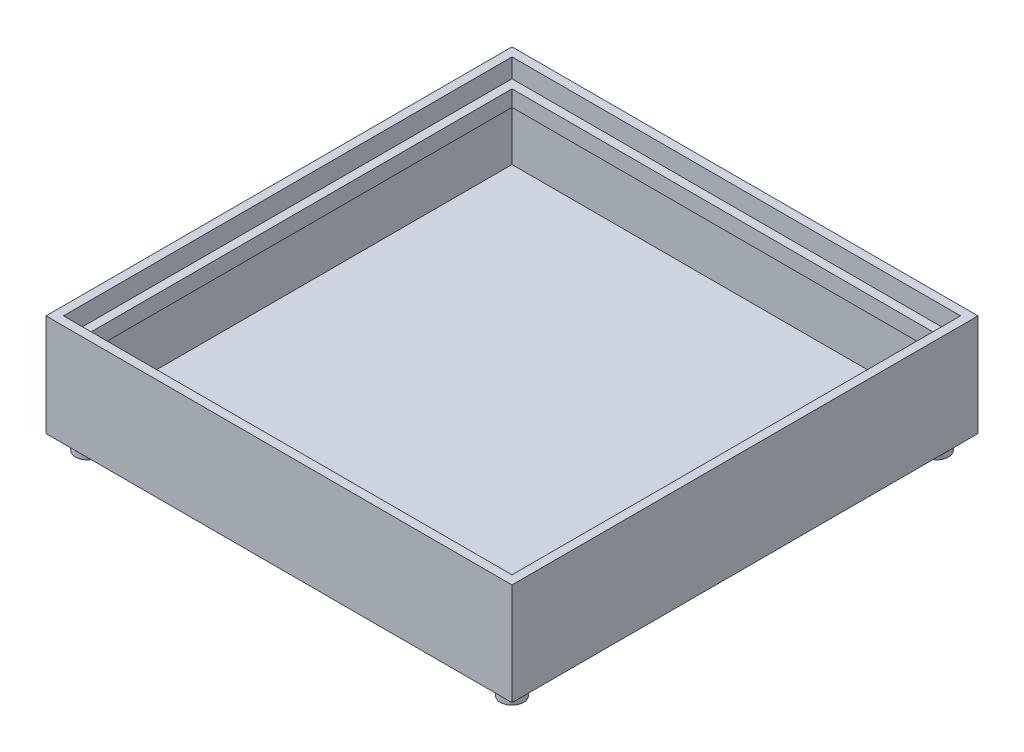
ISO-10303-21;
HEADER;
FILE_DESCRIPTION(('STEP AP214'),'2;1');
FILE_NAME('part.step','',(''),(''),'','','');
FILE_SCHEMA(('AUTOMOTIVE_DESIGN { 1 0 10303 214 1 1 1 1 }'));
ENDSEC;
DATA;
#1=APPLICATION_CONTEXT('core data for automotive mechanical design processes');
#2=APPLICATION_PROTOCOL_DEFINITION('international standard','automotive_design',2000,#1);
#3=PRODUCT_CONTEXT('',#1,'mechanical');
#4=PRODUCT('Part','Part','',(#3));
#5=PRODUCT_RELATED_PRODUCT_CATEGORY('part','',(#4));
#6=PRODUCT_DEFINITION_FORMATION('','',#4);
#7=PRODUCT_DEFINITION_CONTEXT('part definition',#1,'design');
#8=PRODUCT_DEFINITION('design','',#6,#7);
#9=PRODUCT_DEFINITION_SHAPE('','',#8);
#10=(LENGTH_UNIT() NAMED_UNIT(*) SI_UNIT(.MILLI.,.METRE.));
#11=(NAMED_UNIT(*) PLANE_ANGLE_UNIT() SI_UNIT($,.RADIAN.));
#12=(NAMED_UNIT(*) SI_UNIT($,.STERADIAN.) SOLID_ANGLE_UNIT());
#13=UNCERTAINTY_MEASURE_WITH_UNIT(LENGTH_MEASURE(1.E-05),#10,'distance_accuracy_value','');
#14=(GEOMETRIC_REPRESENTATION_CONTEXT(3) GLOBAL_UNCERTAINTY_ASSIGNED_CONTEXT((#13)) GLOBAL_UNIT_ASSIGNED_CONTEXT((#10,
#11,#12)) REPRESENTATION_CONTEXT('',''));
#15=CARTESIAN_POINT('',(0.,0.,0.));
#16=DIRECTION('',(0.,0.,1.));
#17=DIRECTION('',(1.,0.,0.));
#18=AXIS2_PLACEMENT_3D('',#15,#16,#17);
#19=CARTESIAN_POINT('',(-77.,23.,77.));
#20=DIRECTION('',(-1.,0.,0.));
#21=DIRECTION('',(0.,0.,1.));
#22=AXIS2_PLACEMENT_3D('',#19,#20,#21);
#23=PLANE('',#22);
#24=DIRECTION('',(0.,0.,-1.));
#25=VECTOR('',#24,1.);
#26=CARTESIAN_POINT('',(-77.,3.,77.));
#27=LINE('',#26,#25);
#28=CARTESIAN_POINT('',(-77.,3.,77.));
#29=VERTEX_POINT('',#28);
#30=CARTESIAN_POINT('',(-77.,3.,-77.));
#31=VERTEX_POINT('',#30);
#32=EDGE_CURVE('E186',#29,#31,#27,.T.);
#33=ORIENTED_EDGE('',*,*,#32,.T.);
#34=DIRECTION('',(0.,-1.,0.));
#35=VECTOR('',#34,1.);
#36=CARTESIAN_POINT('',(-77.,23.,-77.));
#37=LINE('',#36,#35);
#38=CARTESIAN_POINT('',(-77.,23.,-77.));
#39=VERTEX_POINT('',#38);
#40=EDGE_CURVE('E203',#39,#31,#37,.T.);
#41=ORIENTED_EDGE('',*,*,#40,.F.);
#42=DIRECTION('',(0.,0.,-1.));
#43=VECTOR('',#42,1.);
#44=CARTESIAN_POINT('',(-77.,23.,77.));
#45=LINE('',#44,#43);
#46=CARTESIAN_POINT('',(-77.,23.,77.));
#47=VERTEX_POINT('',#46);
#48=EDGE_CURVE('E190',#47,#39,#45,.T.);
#49=ORIENTED_EDGE('',*,*,#48,.F.);
#50=DIRECTION('',(0.,-1.,0.));
#51=VECTOR('',#50,1.);
#52=CARTESIAN_POINT('',(-77.,23.,77.));
#53=LINE('',#52,#51);
#54=EDGE_CURVE('E214',#47,#29,#53,.T.);
#55=ORIENTED_EDGE('',*,*,#54,.T.);
#56=EDGE_LOOP('',(#33,#41,#49,#55));
#57=FACE_BOUND('',#56,.T.);
#58=ADVANCED_FACE('F45',(#57),#23,.F.);
#59=CARTESIAN_POINT('',(77.,23.,77.));
#60=DIRECTION('',(0.,0.,1.));
#61=DIRECTION('',(1.,0.,0.));
#62=AXIS2_PLACEMENT_3D('',#59,#60,#61);
#63=PLANE('',#62);
#64=DIRECTION('',(-1.,0.,0.));
#65=VECTOR('',#64,1.);
#66=CARTESIAN_POINT('',(77.,3.,77.));
#67=LINE('',#66,#65);
#68=CARTESIAN_POINT('',(77.,3.,77.));
#69=VERTEX_POINT('',#68);
#70=EDGE_CURVE('E194',#69,#29,#67,.T.);
#71=ORIENTED_EDGE('',*,*,#70,.T.);
#72=ORIENTED_EDGE('',*,*,#54,.F.);
#73=DIRECTION('',(-1.,0.,0.));
#74=VECTOR('',#73,1.);
#75=CARTESIAN_POINT('',(77.,23.,77.));
#76=LINE('',#75,#74);
#77=CARTESIAN_POINT('',(77.,23.,77.));
#78=VERTEX_POINT('',#77);
#79=EDGE_CURVE('E200',#78,#47,#76,.T.);
#80=ORIENTED_EDGE('',*,*,#79,.F.);
#81=DIRECTION('',(0.,-1.,0.));
#82=VECTOR('',#81,1.);
#83=CARTESIAN_POINT('',(77.,23.,77.));
#84=LINE('',#83,#82);
#85=EDGE_CURVE('E217',#78,#69,#84,.T.);
#86=ORIENTED_EDGE('',*,*,#85,.T.);
#87=EDGE_LOOP('',(#71,#72,#80,#86));
#88=FACE_BOUND('',#87,.T.);
#89=ADVANCED_FACE('F336',(#88),#63,.F.);
#90=CARTESIAN_POINT('',(77.,23.,77.));
#91=DIRECTION('',(1.,0.,0.));
#92=DIRECTION('',(0.,0.,-1.));
#93=AXIS2_PLACEMENT_3D('',#90,#91,#92);
#94=PLANE('',#93);
#95=DIRECTION('',(0.,0.,1.));
#96=VECTOR('',#95,1.);
#97=CARTESIAN_POINT('',(77.,3.,77.));
#98=LINE('',#97,#96);
#99=CARTESIAN_POINT('',(77.,3.,-77.));
#100=VERTEX_POINT('',#99);
#101=EDGE_CURVE('E209',#100,#69,#98,.T.);
#102=ORIENTED_EDGE('',*,*,#101,.T.);
#103=ORIENTED_EDGE('',*,*,#85,.F.);
#104=DIRECTION('',(0.,0.,1.));
#105=VECTOR('',#104,1.);
#106=CARTESIAN_POINT('',(77.,23.,77.));
#107=LINE('',#106,#105);
#108=CARTESIAN_POINT('',(77.,23.,-77.));
#109=VERTEX_POINT('',#108);
#110=EDGE_CURVE('E197',#109,#78,#107,.T.);
#111=ORIENTED_EDGE('',*,*,#110,.F.);
#112=DIRECTION('',(0.,-1.,0.));
#113=VECTOR('',#112,1.);
#114=CARTESIAN_POINT('',(77.,23.,-77.));
#115=LINE('',#114,#113);
#116=EDGE_CURVE('E219',#109,#100,#115,.T.);
#117=ORIENTED_EDGE('',*,*,#116,.T.);
#118=EDGE_LOOP('',(#102,#103,#111,#117));
#119=FACE_BOUND('',#118,.T.);
#120=ADVANCED_FACE('F343',(#119),#94,.F.);
#121=CARTESIAN_POINT('',(77.,23.,-77.));
#122=DIRECTION('',(0.,0.,-1.));
#123=DIRECTION('',(-1.,0.,0.));
#124=AXIS2_PLACEMENT_3D('',#121,#122,#123);
#125=PLANE('',#124);
#126=DIRECTION('',(1.,0.,0.));
#127=VECTOR('',#126,1.);
#128=CARTESIAN_POINT('',(77.,3.,-77.));
#129=LINE('',#128,#127);
#130=EDGE_CURVE('E206',#31,#100,#129,.T.);
#131=ORIENTED_EDGE('',*,*,#130,.T.);
#132=ORIENTED_EDGE('',*,*,#116,.F.);
#133=DIRECTION('',(1.,0.,0.));
#134=VECTOR('',#133,1.);
#135=CARTESIAN_POINT('',(77.,23.,-77.));
#136=LINE('',#135,#134);
#137=EDGE_CURVE('E193',#39,#109,#136,.T.);
#138=ORIENTED_EDGE('',*,*,#137,.F.);
#139=ORIENTED_EDGE('',*,*,#40,.T.);
#140=EDGE_LOOP('',(#131,#132,#138,#139));
#141=FACE_BOUND('',#140,.T.);
#142=ADVANCED_FACE('F348',(#141),#125,.F.);
#143=CARTESIAN_POINT('',(0.,23.,0.));
#144=DIRECTION('',(0.,1.,0.));
#145=DIRECTION('',(0.,0.,1.));
#146=AXIS2_PLACEMENT_3D('',#143,#144,#145);
#147=PLANE('',#146);
#148=DIRECTION('',(1.,0.,0.));
#149=VECTOR('',#148,1.);
#150=CARTESIAN_POINT('',(0.,23.,74.));
#151=LINE('',#150,#149);
#152=CARTESIAN_POINT('',(-74.,23.,74.));
#153=VERTEX_POINT('',#152);
#154=CARTESIAN_POINT('',(74.,23.,74.));
#155=VERTEX_POINT('',#154);
#156=EDGE_CURVE('E287',#153,#155,#151,.T.);
#157=ORIENTED_EDGE('',*,*,#156,.T.);
#158=DIRECTION('',(0.,0.,-1.));
#159=VECTOR('',#158,1.);
#160=CARTESIAN_POINT('',(74.,23.,0.));
#161=LINE('',#160,#159);
#162=CARTESIAN_POINT('',(74.,23.,-74.));
#163=VERTEX_POINT('',#162);
#164=EDGE_CURVE('E290',#155,#163,#161,.T.);
#165=ORIENTED_EDGE('',*,*,#164,.T.);
#166=DIRECTION('',(-1.,0.,0.));
#167=VECTOR('',#166,1.);
#168=CARTESIAN_POINT('',(0.,23.,-74.));
#169=LINE('',#168,#167);
#170=CARTESIAN_POINT('',(-74.,23.,-74.));
#171=VERTEX_POINT('',#170);
#172=EDGE_CURVE('E163',#163,#171,#169,.T.);
#173=ORIENTED_EDGE('',*,*,#172,.T.);
#174=DIRECTION('',(0.,0.,1.));
#175=VECTOR('',#174,1.);
#176=CARTESIAN_POINT('',(-74.,23.,0.));
#177=LINE('',#176,#175);
#178=EDGE_CURVE('E284',#171,#153,#177,.T.);
#179=ORIENTED_EDGE('',*,*,#178,.T.);
#180=EDGE_LOOP('',(#157,#165,#173,#179));
#181=FACE_BOUND('',#180,.T.);
#182=ORIENTED_EDGE('',*,*,#48,.T.);
#183=ORIENTED_EDGE('',*,*,#137,.T.);
#184=ORIENTED_EDGE('',*,*,#110,.T.);
#185=ORIENTED_EDGE('',*,*,#79,.T.);
#186=EDGE_LOOP('',(#182,#183,#184,#185));
#187=FACE_BOUND('',#186,.T.);
#188=ADVANCED_FACE('F425',(#181,#187),#147,.F.);
#189=CARTESIAN_POINT('',(0.,3.,0.));
#190=DIRECTION('',(0.,1.,0.));
#191=DIRECTION('',(0.,0.,1.));
#192=AXIS2_PLACEMENT_3D('',#189,#190,#191);
#193=PLANE('',#192);
#194=ORIENTED_EDGE('',*,*,#32,.F.);
#195=ORIENTED_EDGE('',*,*,#70,.F.);
#196=ORIENTED_EDGE('',*,*,#101,.F.);
#197=ORIENTED_EDGE('',*,*,#130,.F.);
#198=EDGE_LOOP('',(#194,#195,#196,#197));
#199=FACE_BOUND('',#198,.T.);
#200=ADVANCED_FACE('F435',(#199),#193,.T.);
#201=CARTESIAN_POINT('',(74.,21.,74.));
#202=DIRECTION('',(1.,0.,0.));
#203=DIRECTION('',(0.,0.,-1.));
#204=AXIS2_PLACEMENT_3D('',#201,#202,#203);
#205=PLANE('',#204);
#206=DIRECTION('',(0.,1.,0.));
#207=VECTOR('',#206,1.);
#208=CARTESIAN_POINT('',(74.,21.,74.));
#209=LINE('',#208,#207);
#210=CARTESIAN_POINT('',(74.,28.5,74.));
#211=VERTEX_POINT('',#210);
#212=EDGE_CURVE('E172',#155,#211,#209,.T.);
#213=ORIENTED_EDGE('',*,*,#212,.T.);
#214=DIRECTION('',(0.,0.,-1.));
#215=VECTOR('',#214,1.);
#216=CARTESIAN_POINT('',(74.,28.5,74.));
#217=LINE('',#216,#215);
#218=CARTESIAN_POINT('',(74.,28.5,-74.));
#219=VERTEX_POINT('',#218);
#220=EDGE_CURVE('E169',#211,#219,#217,.T.);
#221=ORIENTED_EDGE('',*,*,#220,.T.);
#222=DIRECTION('',(0.,1.,0.));
#223=VECTOR('',#222,1.);
#224=CARTESIAN_POINT('',(74.,21.,-74.));
#225=LINE('',#224,#223);
#226=EDGE_CURVE('E157',#163,#219,#225,.T.);
#227=ORIENTED_EDGE('',*,*,#226,.F.);
#228=ORIENTED_EDGE('',*,*,#164,.F.);
#229=EDGE_LOOP('',(#213,#221,#227,#228));
#230=FACE_BOUND('',#229,.T.);
#231=ADVANCED_FACE('F170',(#230),#205,.F.);
#232=CARTESIAN_POINT('',(-74.,21.,74.));
#233=DIRECTION('',(0.,0.,1.));
#234=DIRECTION('',(1.,0.,0.));
#235=AXIS2_PLACEMENT_3D('',#232,#233,#234);
#236=PLANE('',#235);
#237=DIRECTION('',(0.,1.,0.));
#238=VECTOR('',#237,1.);
#239=CARTESIAN_POINT('',(-74.,21.,74.));
#240=LINE('',#239,#238);
#241=CARTESIAN_POINT('',(-74.,28.5,74.));
#242=VERTEX_POINT('',#241);
#243=EDGE_CURVE('E187',#153,#242,#240,.T.);
#244=ORIENTED_EDGE('',*,*,#243,.T.);
#245=DIRECTION('',(1.,0.,0.));
#246=VECTOR('',#245,1.);
#247=CARTESIAN_POINT('',(-74.,28.5,74.));
#248=LINE('',#247,#246);
#249=EDGE_CURVE('E166',#242,#211,#248,.T.);
#250=ORIENTED_EDGE('',*,*,#249,.T.);
#251=ORIENTED_EDGE('',*,*,#212,.F.);
#252=ORIENTED_EDGE('',*,*,#156,.F.);
#253=EDGE_LOOP('',(#244,#250,#251,#252));
#254=FACE_BOUND('',#253,.T.);
#255=ADVANCED_FACE('F453',(#254),#236,.F.);
#256=CARTESIAN_POINT('',(-74.,21.,74.));
#257=DIRECTION('',(-1.,0.,0.));
#258=DIRECTION('',(0.,0.,1.));
#259=AXIS2_PLACEMENT_3D('',#256,#257,#258);
#260=PLANE('',#259);
#261=DIRECTION('',(0.,1.,0.));
#262=VECTOR('',#261,1.);
#263=CARTESIAN_POINT('',(-74.,21.,-74.));
#264=LINE('',#263,#262);
#265=CARTESIAN_POINT('',(-74.,28.5,-74.));
#266=VERTEX_POINT('',#265);
#267=EDGE_CURVE('E67',#171,#266,#264,.T.);
#268=ORIENTED_EDGE('',*,*,#267,.T.);
#269=DIRECTION('',(0.,0.,1.));
#270=VECTOR('',#269,1.);
#271=CARTESIAN_POINT('',(-74.,28.5,74.));
#272=LINE('',#271,#270);
#273=EDGE_CURVE('E60',#266,#242,#272,.T.);
#274=ORIENTED_EDGE('',*,*,#273,.T.);
#275=ORIENTED_EDGE('',*,*,#243,.F.);
#276=ORIENTED_EDGE('',*,*,#178,.F.);
#277=EDGE_LOOP('',(#268,#274,#275,#276));
#278=FACE_BOUND('',#277,.T.);
#279=ADVANCED_FACE('F462',(#278),#260,.F.);
#280=CARTESIAN_POINT('',(-74.,21.,-74.));
#281=DIRECTION('',(0.,0.,-1.));
#282=DIRECTION('',(-1.,0.,0.));
#283=AXIS2_PLACEMENT_3D('',#280,#281,#282);
#284=PLANE('',#283);
#285=ORIENTED_EDGE('',*,*,#226,.T.);
#286=DIRECTION('',(-1.,0.,0.));
#287=VECTOR('',#286,1.);
#288=CARTESIAN_POINT('',(-74.,28.5,-74.));
#289=LINE('',#288,#287);
#290=EDGE_CURVE('E161',#219,#266,#289,.T.);
#291=ORIENTED_EDGE('',*,*,#290,.T.);
#292=ORIENTED_EDGE('',*,*,#267,.F.);
#293=ORIENTED_EDGE('',*,*,#172,.F.);
#294=EDGE_LOOP('',(#285,#291,#292,#293));
#295=FACE_BOUND('',#294,.T.);
#296=ADVANCED_FACE('F159',(#295),#284,.F.);
#297=CARTESIAN_POINT('',(80.,35.,80.));
#298=DIRECTION('',(-1.,0.,0.));
#299=DIRECTION('',(0.,0.,1.));
#300=AXIS2_PLACEMENT_3D('',#297,#298,#299);
#301=PLANE('',#300);
#302=DIRECTION('',(0.,0.,-1.));
#303=VECTOR('',#302,1.);
#304=CARTESIAN_POINT('',(80.,0.,80.));
#305=LINE('',#304,#303);
#306=CARTESIAN_POINT('',(80.,0.,80.));
#307=VERTEX_POINT('',#306);
#308=CARTESIAN_POINT('',(80.,0.,-80.));
#309=VERTEX_POINT('',#308);
#310=EDGE_CURVE('E247',#307,#309,#305,.T.);
#311=ORIENTED_EDGE('',*,*,#310,.T.);
#312=DIRECTION('',(0.,-1.,0.));
#313=VECTOR('',#312,1.);
#314=CARTESIAN_POINT('',(80.,35.,-80.));
#315=LINE('',#314,#313);
#316=CARTESIAN_POINT('',(80.,35.,-80.));
#317=VERTEX_POINT('',#316);
#318=EDGE_CURVE('E280',#317,#309,#315,.T.);
#319=ORIENTED_EDGE('',*,*,#318,.F.);
#320=DIRECTION('',(0.,0.,-1.));
#321=VECTOR('',#320,1.);
#322=CARTESIAN_POINT('',(80.,35.,80.));
#323=LINE('',#322,#321);
#324=CARTESIAN_POINT('',(80.,35.,80.));
#325=VERTEX_POINT('',#324);
#326=EDGE_CURVE('E254',#325,#317,#323,.T.);
#327=ORIENTED_EDGE('',*,*,#326,.F.);
#328=DIRECTION('',(0.,-1.,0.));
#329=VECTOR('',#328,1.);
#330=CARTESIAN_POINT('',(80.,35.,80.));
#331=LINE('',#330,#329);
#332=EDGE_CURVE('E264',#325,#307,#331,.T.);
#333=ORIENTED_EDGE('',*,*,#332,.T.);
#334=EDGE_LOOP('',(#311,#319,#327,#333));
#335=FACE_BOUND('',#334,.T.);
#336=ADVANCED_FACE('F47',(#335),#301,.F.);
#337=CARTESIAN_POINT('',(-80.,35.,-80.));
#338=DIRECTION('',(0.,0.,1.));
#339=DIRECTION('',(1.,0.,0.));
#340=AXIS2_PLACEMENT_3D('',#337,#338,#339);
#341=PLANE('',#340);
#342=DIRECTION('',(-1.,0.,0.));
#343=VECTOR('',#342,1.);
#344=CARTESIAN_POINT('',(-80.,0.,-80.));
#345=LINE('',#344,#343);
#346=CARTESIAN_POINT('',(-80.,0.,-80.));
#347=VERTEX_POINT('',#346);
#348=EDGE_CURVE('E267',#309,#347,#345,.T.);
#349=ORIENTED_EDGE('',*,*,#348,.T.);
#350=DIRECTION('',(0.,-1.,0.));
#351=VECTOR('',#350,1.);
#352=CARTESIAN_POINT('',(-80.,35.,-80.));
#353=LINE('',#352,#351);
#354=CARTESIAN_POINT('',(-80.,35.,-80.));
#355=VERTEX_POINT('',#354);
#356=EDGE_CURVE('E277',#355,#347,#353,.T.);
#357=ORIENTED_EDGE('',*,*,#356,.F.);
#358=DIRECTION('',(-1.,0.,0.));
#359=VECTOR('',#358,1.);
#360=CARTESIAN_POINT('',(-80.,35.,-80.));
#361=LINE('',#360,#359);
#362=EDGE_CURVE('E257',#317,#355,#361,.T.);
#363=ORIENTED_EDGE('',*,*,#362,.F.);
#364=ORIENTED_EDGE('',*,*,#318,.T.);
#365=EDGE_LOOP('',(#349,#357,#363,#364));
#366=FACE_BOUND('',#365,.T.);
#367=ADVANCED_FACE('F323',(#366),#341,.F.);
#368=CARTESIAN_POINT('',(-80.,35.,80.));
#369=DIRECTION('',(1.,0.,0.));
#370=DIRECTION('',(0.,0.,-1.));
#371=AXIS2_PLACEMENT_3D('',#368,#369,#370);
#372=PLANE('',#371);
#373=DIRECTION('',(0.,0.,1.));
#374=VECTOR('',#373,1.);
#375=CARTESIAN_POINT('',(-80.,0.,80.));
#376=LINE('',#375,#374);
#377=CARTESIAN_POINT('',(-80.,0.,80.));
#378=VERTEX_POINT('',#377);
#379=EDGE_CURVE('E269',#347,#378,#376,.T.);
#380=ORIENTED_EDGE('',*,*,#379,.T.);
#381=DIRECTION('',(0.,-1.,0.));
#382=VECTOR('',#381,1.);
#383=CARTESIAN_POINT('',(-80.,35.,80.));
#384=LINE('',#383,#382);
#385=CARTESIAN_POINT('',(-80.,35.,80.));
#386=VERTEX_POINT('',#385);
#387=EDGE_CURVE('E274',#386,#378,#384,.T.);
#388=ORIENTED_EDGE('',*,*,#387,.F.);
#389=DIRECTION('',(0.,0.,1.));
#390=VECTOR('',#389,1.);
#391=CARTESIAN_POINT('',(-80.,35.,80.));
#392=LINE('',#391,#390);
#393=EDGE_CURVE('E260',#355,#386,#392,.T.);
#394=ORIENTED_EDGE('',*,*,#393,.F.);
#395=ORIENTED_EDGE('',*,*,#356,.T.);
#396=EDGE_LOOP('',(#380,#388,#394,#395));
#397=FACE_BOUND('',#396,.T.);
#398=ADVANCED_FACE('F320',(#397),#372,.F.);
#399=CARTESIAN_POINT('',(-80.,35.,80.));
#400=DIRECTION('',(0.,0.,-1.));
#401=DIRECTION('',(-1.,0.,0.));
#402=AXIS2_PLACEMENT_3D('',#399,#400,#401);
#403=PLANE('',#402);
#404=DIRECTION('',(1.,0.,0.));
#405=VECTOR('',#404,1.);
#406=CARTESIAN_POINT('',(-80.,0.,80.));
#407=LINE('',#406,#405);
#408=EDGE_CURVE('E258',#378,#307,#407,.T.);
#409=ORIENTED_EDGE('',*,*,#408,.T.);
#410=ORIENTED_EDGE('',*,*,#332,.F.);
#411=DIRECTION('',(1.,0.,0.));
#412=VECTOR('',#411,1.);
#413=CARTESIAN_POINT('',(-80.,35.,80.));
#414=LINE('',#413,#412);
#415=EDGE_CURVE('E262',#386,#325,#414,.T.);
#416=ORIENTED_EDGE('',*,*,#415,.F.);
#417=ORIENTED_EDGE('',*,*,#387,.T.);
#418=EDGE_LOOP('',(#409,#410,#416,#417));
#419=FACE_BOUND('',#418,.T.);
#420=ADVANCED_FACE('F316',(#419),#403,.F.);
#421=CARTESIAN_POINT('',(0.,35.,0.));
#422=DIRECTION('',(0.,-1.,0.));
#423=DIRECTION('',(0.,0.,-1.));
#424=AXIS2_PLACEMENT_3D('',#421,#422,#423);
#425=PLANE('',#424);
#426=DIRECTION('',(1.,0.,0.));
#427=VECTOR('',#426,1.);
#428=CARTESIAN_POINT('',(77.,35.,76.9999999999999));
#429=LINE('',#428,#427);
#430=CARTESIAN_POINT('',(-77.,35.,76.9999999999999));
#431=VERTEX_POINT('',#430);
#432=CARTESIAN_POINT('',(77.,35.,76.9999999999999));
#433=VERTEX_POINT('',#432);
#434=EDGE_CURVE('E237',#431,#433,#429,.T.);
#435=ORIENTED_EDGE('',*,*,#434,.F.);
#436=DIRECTION('',(0.,0.,1.));
#437=VECTOR('',#436,1.);
#438=CARTESIAN_POINT('',(-77.,35.,76.9999999999999));
#439=LINE('',#438,#437);
#440=CARTESIAN_POINT('',(-77.,35.,-77.));
#441=VERTEX_POINT('',#440);
#442=EDGE_CURVE('E216',#441,#431,#439,.T.);
#443=ORIENTED_EDGE('',*,*,#442,.F.);
#444=DIRECTION('',(-1.,0.,0.));
#445=VECTOR('',#444,1.);
#446=CARTESIAN_POINT('',(77.,35.,-77.0000000000001));
#447=LINE('',#446,#445);
#448=CARTESIAN_POINT('',(77.,35.,-77.0000000000001));
#449=VERTEX_POINT('',#448);
#450=EDGE_CURVE('E226',#449,#441,#447,.T.);
#451=ORIENTED_EDGE('',*,*,#450,.F.);
#452=DIRECTION('',(0.,0.,-1.));
#453=VECTOR('',#452,1.);
#454=CARTESIAN_POINT('',(77.,35.,76.9999999999999));
#455=LINE('',#454,#453);
#456=EDGE_CURVE('E240',#433,#449,#455,.T.);
#457=ORIENTED_EDGE('',*,*,#456,.F.);
#458=EDGE_LOOP('',(#435,#443,#451,#457));
#459=FACE_BOUND('',#458,.T.);
#460=ORIENTED_EDGE('',*,*,#326,.T.);
#461=ORIENTED_EDGE('',*,*,#362,.T.);
#462=ORIENTED_EDGE('',*,*,#393,.T.);
#463=ORIENTED_EDGE('',*,*,#415,.T.);
#464=EDGE_LOOP('',(#460,#461,#462,#463));
#465=FACE_BOUND('',#464,.T.);
#466=ADVANCED_FACE('F300',(#459,#465),#425,.F.);
#467=CARTESIAN_POINT('',(0.,0.,0.));
#468=DIRECTION('',(0.,-1.,0.));
#469=DIRECTION('',(0.,0.,-1.));
#470=AXIS2_PLACEMENT_3D('',#467,#468,#469);
#471=PLANE('',#470);
#472=CARTESIAN_POINT('',(72.9289321881345,0.,-72.9289321881345));
#473=DIRECTION('',(0.,-1.,0.));
#474=DIRECTION('',(0.,0.,1.));
#475=AXIS2_PLACEMENT_3D('',#472,#473,#474);
#476=CIRCLE('',#475,4.00000000000001);
#477=CARTESIAN_POINT('',(72.9289321881345,0.,-68.9289321881345));
#478=VERTEX_POINT('',#477);
#479=EDGE_CURVE('E593',#478,#478,#476,.T.);
#480=ORIENTED_EDGE('',*,*,#479,.F.);
#481=EDGE_LOOP('',(#480));
#482=FACE_BOUND('',#481,.T.);
#483=CARTESIAN_POINT('',(-72.9289321881345,0.,-72.9289321881345));
#484=DIRECTION('',(0.,-1.,0.));
#485=DIRECTION('',(0.,0.,-1.));
#486=AXIS2_PLACEMENT_3D('',#483,#484,#485);
#487=CIRCLE('',#486,4.00000000000001);
#488=CARTESIAN_POINT('',(-72.9289321881345,0.,-76.9289321881345));
#489=VERTEX_POINT('',#488);
#490=EDGE_CURVE('E11',#489,#489,#487,.T.);
#491=ORIENTED_EDGE('',*,*,#490,.F.);
#492=EDGE_LOOP('',(#491));
#493=FACE_BOUND('',#492,.T.);
#494=CARTESIAN_POINT('',(72.9289321881345,0.,72.9289321881345));
#495=DIRECTION('',(0.,-1.,0.));
#496=DIRECTION('',(0.,0.,-1.));
#497=AXIS2_PLACEMENT_3D('',#494,#495,#496);
#498=CIRCLE('',#497,4.00000000000001);
#499=CARTESIAN_POINT('',(72.9289321881345,0.,68.9289321881345));
#500=VERTEX_POINT('',#499);
#501=EDGE_CURVE('E53',#500,#500,#498,.T.);
#502=ORIENTED_EDGE('',*,*,#501,.F.);
#503=EDGE_LOOP('',(#502));
#504=FACE_BOUND('',#503,.T.);
#505=CARTESIAN_POINT('',(-72.9289321881345,0.,72.9289321881345));
#506=DIRECTION('',(0.,-1.,0.));
#507=DIRECTION('',(0.,0.,-1.));
#508=AXIS2_PLACEMENT_3D('',#505,#506,#507);
#509=CIRCLE('',#508,4.00000000000001);
#510=CARTESIAN_POINT('',(-72.9289321881345,0.,68.9289321881345));
#511=VERTEX_POINT('',#510);
#512=EDGE_CURVE('E306',#511,#511,#509,.T.);
#513=ORIENTED_EDGE('',*,*,#512,.F.);
#514=EDGE_LOOP('',(#513));
#515=FACE_BOUND('',#514,.T.);
#516=ORIENTED_EDGE('',*,*,#310,.F.);
#517=ORIENTED_EDGE('',*,*,#408,.F.);
#518=ORIENTED_EDGE('',*,*,#379,.F.);
#519=ORIENTED_EDGE('',*,*,#348,.F.);
#520=EDGE_LOOP('',(#516,#517,#518,#519));
#521=FACE_BOUND('',#520,.T.);
#522=ADVANCED_FACE('F296',(#482,#493,#504,#515,#521),#471,.T.);
#523=CARTESIAN_POINT('',(-77.,28.5,76.9999999999999));
#524=DIRECTION('',(-1.,0.,0.));
#525=DIRECTION('',(0.,0.,1.));
#526=AXIS2_PLACEMENT_3D('',#523,#524,#525);
#527=PLANE('',#526);
#528=ORIENTED_EDGE('',*,*,#442,.T.);
#529=DIRECTION('',(0.,1.,0.));
#530=VECTOR('',#529,1.);
#531=CARTESIAN_POINT('',(-77.,28.5,76.9999999999999));
#532=LINE('',#531,#530);
#533=CARTESIAN_POINT('',(-77.,28.5,76.9999999999999));
#534=VERTEX_POINT('',#533);
#535=EDGE_CURVE('E235',#534,#431,#532,.T.);
#536=ORIENTED_EDGE('',*,*,#535,.F.);
#537=DIRECTION('',(0.,0.,1.));
#538=VECTOR('',#537,1.);
#539=CARTESIAN_POINT('',(-77.,28.5,76.9999999999999));
#540=LINE('',#539,#538);
#541=CARTESIAN_POINT('',(-77.,28.5,-77.));
#542=VERTEX_POINT('',#541);
#543=EDGE_CURVE('E222',#542,#534,#540,.T.);
#544=ORIENTED_EDGE('',*,*,#543,.F.);
#545=DIRECTION('',(0.,1.,0.));
#546=VECTOR('',#545,1.);
#547=CARTESIAN_POINT('',(-77.,28.5,-77.));
#548=LINE('',#547,#546);
#549=EDGE_CURVE('E245',#542,#441,#548,.T.);
#550=ORIENTED_EDGE('',*,*,#549,.T.);
#551=EDGE_LOOP('',(#528,#536,#544,#550));
#552=FACE_BOUND('',#551,.T.);
#553=ADVANCED_FACE('F299',(#552),#527,.F.);
#554=CARTESIAN_POINT('',(77.,28.5,-77.0000000000001));
#555=DIRECTION('',(0.,0.,-1.));
#556=DIRECTION('',(-1.,0.,0.));
#557=AXIS2_PLACEMENT_3D('',#554,#555,#556);
#558=PLANE('',#557);
#559=ORIENTED_EDGE('',*,*,#450,.T.);
#560=ORIENTED_EDGE('',*,*,#549,.F.);
#561=DIRECTION('',(-1.,0.,0.));
#562=VECTOR('',#561,1.);
#563=CARTESIAN_POINT('',(77.,28.5,-77.0000000000001));
#564=LINE('',#563,#562);
#565=CARTESIAN_POINT('',(77.,28.5,-77.0000000000001));
#566=VERTEX_POINT('',#565);
#567=EDGE_CURVE('E232',#566,#542,#564,.T.);
#568=ORIENTED_EDGE('',*,*,#567,.F.);
#569=DIRECTION('',(0.,1.,0.));
#570=VECTOR('',#569,1.);
#571=CARTESIAN_POINT('',(77.,28.5,-77.0000000000001));
#572=LINE('',#571,#570);
#573=EDGE_CURVE('E248',#566,#449,#572,.T.);
#574=ORIENTED_EDGE('',*,*,#573,.T.);
#575=EDGE_LOOP('',(#559,#560,#568,#574));
#576=FACE_BOUND('',#575,.T.);
#577=ADVANCED_FACE('F354',(#576),#558,.F.);
#578=CARTESIAN_POINT('',(77.,28.5,76.9999999999999));
#579=DIRECTION('',(1.,0.,0.));
#580=DIRECTION('',(0.,0.,-1.));
#581=AXIS2_PLACEMENT_3D('',#578,#579,#580);
#582=PLANE('',#581);
#583=ORIENTED_EDGE('',*,*,#456,.T.);
#584=ORIENTED_EDGE('',*,*,#573,.F.);
#585=DIRECTION('',(0.,0.,-1.));
#586=VECTOR('',#585,1.);
#587=CARTESIAN_POINT('',(77.,28.5,76.9999999999999));
#588=LINE('',#587,#586);
#589=CARTESIAN_POINT('',(77.,28.5,76.9999999999999));
#590=VERTEX_POINT('',#589);
#591=EDGE_CURVE('E229',#590,#566,#588,.T.);
#592=ORIENTED_EDGE('',*,*,#591,.F.);
#593=DIRECTION('',(0.,1.,0.));
#594=VECTOR('',#593,1.);
#595=CARTESIAN_POINT('',(77.,28.5,76.9999999999999));
#596=LINE('',#595,#594);
#597=EDGE_CURVE('E250',#590,#433,#596,.T.);
#598=ORIENTED_EDGE('',*,*,#597,.T.);
#599=EDGE_LOOP('',(#583,#584,#592,#598));
#600=FACE_BOUND('',#599,.T.);
#601=ADVANCED_FACE('F357',(#600),#582,.F.);
#602=CARTESIAN_POINT('',(77.,28.5,76.9999999999999));
#603=DIRECTION('',(0.,0.,1.));
#604=DIRECTION('',(1.,0.,0.));
#605=AXIS2_PLACEMENT_3D('',#602,#603,#604);
#606=PLANE('',#605);
#607=ORIENTED_EDGE('',*,*,#434,.T.);
#608=ORIENTED_EDGE('',*,*,#597,.F.);
#609=DIRECTION('',(1.,0.,0.));
#610=VECTOR('',#609,1.);
#611=CARTESIAN_POINT('',(77.,28.5,76.9999999999999));
#612=LINE('',#611,#610);
#613=EDGE_CURVE('E225',#534,#590,#612,.T.);
#614=ORIENTED_EDGE('',*,*,#613,.F.);
#615=ORIENTED_EDGE('',*,*,#535,.T.);
#616=EDGE_LOOP('',(#607,#608,#614,#615));
#617=FACE_BOUND('',#616,.T.);
#618=ADVANCED_FACE('F353',(#617),#606,.F.);
#619=CARTESIAN_POINT('',(0.,28.5,0.));
#620=DIRECTION('',(0.,1.,0.));
#621=DIRECTION('',(0.,0.,1.));
#622=AXIS2_PLACEMENT_3D('',#619,#620,#621);
#623=PLANE('',#622);
#624=ORIENTED_EDGE('',*,*,#220,.F.);
#625=ORIENTED_EDGE('',*,*,#249,.F.);
#626=ORIENTED_EDGE('',*,*,#273,.F.);
#627=ORIENTED_EDGE('',*,*,#290,.F.);
#628=EDGE_LOOP('',(#624,#625,#626,#627));
#629=FACE_BOUND('',#628,.T.);
#630=ORIENTED_EDGE('',*,*,#543,.T.);
#631=ORIENTED_EDGE('',*,*,#613,.T.);
#632=ORIENTED_EDGE('',*,*,#591,.T.);
#633=ORIENTED_EDGE('',*,*,#567,.T.);
#634=EDGE_LOOP('',(#630,#631,#632,#633));
#635=FACE_BOUND('',#634,.T.);
#636=ADVANCED_FACE('F178',(#629,#635),#623,.T.);
#637=CARTESIAN_POINT('',(-72.9289321881345,-5.,72.9289321881345));
#638=DIRECTION('',(0.,1.,0.));
#639=DIRECTION('',(0.,0.,1.));
#640=AXIS2_PLACEMENT_3D('',#637,#638,#639);
#641=CYLINDRICAL_SURFACE('',#640,4.00000000000001);
#642=CARTESIAN_POINT('',(-72.9289321881345,-5.,72.9289321881345));
#643=DIRECTION('',(0.,-1.,0.));
#644=DIRECTION('',(0.,0.,-1.));
#645=AXIS2_PLACEMENT_3D('',#642,#643,#644);
#646=CIRCLE('',#645,4.00000000000001);
#647=CARTESIAN_POINT('',(-72.9289321881345,-5.,68.9289321881345));
#648=VERTEX_POINT('',#647);
#649=EDGE_CURVE('E176',#648,#648,#646,.T.);
#650=ORIENTED_EDGE('',*,*,#649,.F.);
#651=EDGE_LOOP('',(#650));
#652=FACE_BOUND('',#651,.T.);
#653=ORIENTED_EDGE('',*,*,#512,.T.);
#654=EDGE_LOOP('',(#653));
#655=FACE_BOUND('',#654,.T.);
#656=ADVANCED_FACE('F352',(#652,#655),#641,.T.);
#657=CARTESIAN_POINT('',(-72.9289321881345,-5.,72.9289321881345));
#658=DIRECTION('',(0.,-1.,0.));
#659=DIRECTION('',(0.,0.,-1.));
#660=AXIS2_PLACEMENT_3D('',#657,#658,#659);
#661=PLANE('',#660);
#662=ORIENTED_EDGE('',*,*,#649,.T.);
#663=EDGE_LOOP('',(#662));
#664=FACE_BOUND('',#663,.T.);
#665=ADVANCED_FACE('F486',(#664),#661,.T.);
#666=CARTESIAN_POINT('',(72.9289321881345,-5.,72.9289321881345));
#667=DIRECTION('',(0.,1.,0.));
#668=DIRECTION('',(0.,0.,1.));
#669=AXIS2_PLACEMENT_3D('',#666,#667,#668);
#670=CYLINDRICAL_SURFACE('',#669,4.00000000000001);
#671=CARTESIAN_POINT('',(72.9289321881345,-5.,72.9289321881345));
#672=DIRECTION('',(0.,1.,0.));
#673=DIRECTION('',(0.,0.,-1.));
#674=AXIS2_PLACEMENT_3D('',#671,#672,#673);
#675=CIRCLE('',#674,4.00000000000001);
#676=CARTESIAN_POINT('',(72.9289321881345,-5.,68.9289321881345));
#677=VERTEX_POINT('',#676);
#678=EDGE_CURVE('E596',#677,#677,#675,.T.);
#679=ORIENTED_EDGE('',*,*,#678,.T.);
#680=EDGE_LOOP('',(#679));
#681=FACE_BOUND('',#680,.T.);
#682=ORIENTED_EDGE('',*,*,#501,.T.);
#683=EDGE_LOOP('',(#682));
#684=FACE_BOUND('',#683,.T.);
#685=ADVANCED_FACE('F294',(#681,#684),#670,.T.);
#686=CARTESIAN_POINT('',(72.9289321881345,-5.,72.9289321881345));
#687=DIRECTION('',(0.,-1.,0.));
#688=DIRECTION('',(0.,0.,-1.));
#689=AXIS2_PLACEMENT_3D('',#686,#687,#688);
#690=PLANE('',#689);
#691=ORIENTED_EDGE('',*,*,#678,.F.);
#692=EDGE_LOOP('',(#691));
#693=FACE_BOUND('',#692,.T.);
#694=ADVANCED_FACE('F506',(#693),#690,.T.);
#695=CARTESIAN_POINT('',(-72.9289321881345,-5.,-72.9289321881345));
#696=DIRECTION('',(0.,1.,0.));
#697=DIRECTION('',(0.,0.,1.));
#698=AXIS2_PLACEMENT_3D('',#695,#696,#697);
#699=CYLINDRICAL_SURFACE('',#698,4.00000000000001);
#700=CARTESIAN_POINT('',(-72.9289321881345,-5.,-72.9289321881345));
#701=DIRECTION('',(0.,1.,0.));
#702=DIRECTION('',(0.,0.,1.));
#703=AXIS2_PLACEMENT_3D('',#700,#701,#702);
#704=CIRCLE('',#703,4.00000000000001);
#705=CARTESIAN_POINT('',(-72.9289321881345,-5.,-68.9289321881345));
#706=VERTEX_POINT('',#705);
#707=EDGE_CURVE('E592',#706,#706,#704,.T.);
#708=ORIENTED_EDGE('',*,*,#707,.T.);
#709=EDGE_LOOP('',(#708));
#710=FACE_BOUND('',#709,.T.);
#711=ORIENTED_EDGE('',*,*,#490,.T.);
#712=EDGE_LOOP('',(#711));
#713=FACE_BOUND('',#712,.T.);
#714=ADVANCED_FACE('F517',(#710,#713),#699,.T.);
#715=CARTESIAN_POINT('',(-72.9289321881345,-5.,-72.9289321881345));
#716=DIRECTION('',(0.,-1.,0.));
#717=DIRECTION('',(0.,0.,1.));
#718=AXIS2_PLACEMENT_3D('',#715,#716,#717);
#719=PLANE('',#718);
#720=ORIENTED_EDGE('',*,*,#707,.F.);
#721=EDGE_LOOP('',(#720));
#722=FACE_BOUND('',#721,.T.);
#723=ADVANCED_FACE('F528',(#722),#719,.T.);
#724=CARTESIAN_POINT('',(72.9289321881345,-5.,-72.9289321881345));
#725=DIRECTION('',(0.,1.,0.));
#726=DIRECTION('',(0.,0.,1.));
#727=AXIS2_PLACEMENT_3D('',#724,#725,#726);
#728=CYLINDRICAL_SURFACE('',#727,4.00000000000001);
#729=CARTESIAN_POINT('',(72.9289321881345,-5.,-72.9289321881345));
#730=DIRECTION('',(0.,-1.,0.));
#731=DIRECTION('',(0.,0.,1.));
#732=AXIS2_PLACEMENT_3D('',#729,#730,#731);
#733=CIRCLE('',#732,4.00000000000001);
#734=CARTESIAN_POINT('',(72.9289321881345,-5.,-68.9289321881345));
#735=VERTEX_POINT('',#734);
#736=EDGE_CURVE('E591',#735,#735,#733,.T.);
#737=ORIENTED_EDGE('',*,*,#736,.F.);
#738=EDGE_LOOP('',(#737));
#739=FACE_BOUND('',#738,.T.);
#740=ORIENTED_EDGE('',*,*,#479,.T.);
#741=EDGE_LOOP('',(#740));
#742=FACE_BOUND('',#741,.T.);
#743=ADVANCED_FACE('F539',(#739,#742),#728,.T.);
#744=CARTESIAN_POINT('',(72.9289321881345,-5.,-72.9289321881345));
#745=DIRECTION('',(0.,-1.,0.));
#746=DIRECTION('',(0.,0.,1.));
#747=AXIS2_PLACEMENT_3D('',#744,#745,#746);
#748=PLANE('',#747);
#749=ORIENTED_EDGE('',*,*,#736,.T.);
#750=EDGE_LOOP('',(#749));
#751=FACE_BOUND('',#750,.T.);
#752=ADVANCED_FACE('F550',(#751),#748,.T.);
#753=CLOSED_SHELL('',(#58,#89,#120,#142,#188,#200,#231,#255,#279,#296,#336,#367,#398,#420,#466,
#522,#553,#577,#601,#618,#636,#656,#665,#685,#694,#714,#723,#743,#752));
#754=MANIFOLD_SOLID_BREP('B2',#753);
#755=ADVANCED_BREP_SHAPE_REPRESENTATION('',(#18,#754),#14);
#756=SHAPE_DEFINITION_REPRESENTATION(#9,#755);
ENDSEC;
END-ISO-10303-21;
